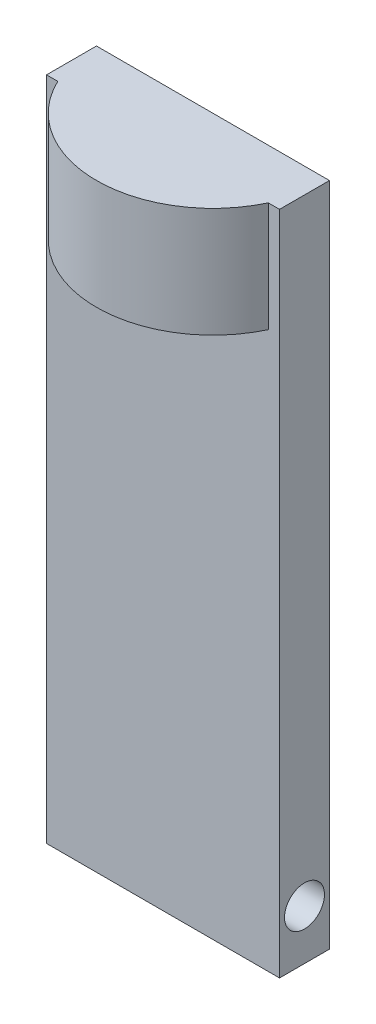
ISO-10303-21;
HEADER;
FILE_DESCRIPTION(('STEP AP214'),'2;1');
FILE_NAME('part.step','',(''),(''),'','','');
FILE_SCHEMA(('AUTOMOTIVE_DESIGN { 1 0 10303 214 1 1 1 1 }'));
ENDSEC;
DATA;
#1=APPLICATION_CONTEXT('core data for automotive mechanical design processes');
#2=APPLICATION_PROTOCOL_DEFINITION('international standard','automotive_design',2000,#1);
#3=PRODUCT_CONTEXT('',#1,'mechanical');
#4=PRODUCT('Part','Part','',(#3));
#5=PRODUCT_RELATED_PRODUCT_CATEGORY('part','',(#4));
#6=PRODUCT_DEFINITION_FORMATION('','',#4);
#7=PRODUCT_DEFINITION_CONTEXT('part definition',#1,'design');
#8=PRODUCT_DEFINITION('design','',#6,#7);
#9=PRODUCT_DEFINITION_SHAPE('','',#8);
#10=(LENGTH_UNIT() NAMED_UNIT(*) SI_UNIT(.MILLI.,.METRE.));
#11=(NAMED_UNIT(*) PLANE_ANGLE_UNIT() SI_UNIT($,.RADIAN.));
#12=(NAMED_UNIT(*) SI_UNIT($,.STERADIAN.) SOLID_ANGLE_UNIT());
#13=UNCERTAINTY_MEASURE_WITH_UNIT(LENGTH_MEASURE(1.E-05),#10,'distance_accuracy_value','');
#14=(GEOMETRIC_REPRESENTATION_CONTEXT(3) GLOBAL_UNCERTAINTY_ASSIGNED_CONTEXT((#13)) GLOBAL_UNIT_ASSIGNED_CONTEXT((#10,
#11,#12)) REPRESENTATION_CONTEXT('',''));
#15=CARTESIAN_POINT('',(0.,0.,0.));
#16=DIRECTION('',(0.,0.,1.));
#17=DIRECTION('',(1.,0.,0.));
#18=AXIS2_PLACEMENT_3D('',#15,#16,#17);
#19=CARTESIAN_POINT('',(35.,100.,15.));
#20=DIRECTION('',(-1.,0.,0.));
#21=DIRECTION('',(0.,-1.,0.));
#22=AXIS2_PLACEMENT_3D('',#19,#20,#21);
#23=PLANE('',#22);
#24=CARTESIAN_POINT('',(35.,-85.,7.5));
#25=DIRECTION('',(1.,0.,0.));
#26=DIRECTION('',(0.,1.,0.));
#27=AXIS2_PLACEMENT_3D('',#24,#25,#26);
#28=CIRCLE('',#27,6.);
#29=CARTESIAN_POINT('',(35.,-79.,7.5));
#30=VERTEX_POINT('',#29);
#31=EDGE_CURVE('E122',#30,#30,#28,.T.);
#32=ORIENTED_EDGE('',*,*,#31,.F.);
#33=EDGE_LOOP('',(#32));
#34=FACE_BOUND('',#33,.T.);
#35=DIRECTION('',(0.,1.,0.));
#36=VECTOR('',#35,1.);
#37=CARTESIAN_POINT('',(35.,100.,0.));
#38=LINE('',#37,#36);
#39=CARTESIAN_POINT('',(35.,-100.,0.));
#40=VERTEX_POINT('',#39);
#41=CARTESIAN_POINT('',(35.,100.,0.));
#42=VERTEX_POINT('',#41);
#43=EDGE_CURVE('E128',#40,#42,#38,.T.);
#44=ORIENTED_EDGE('',*,*,#43,.T.);
#45=DIRECTION('',(0.,0.,-1.));
#46=VECTOR('',#45,1.);
#47=CARTESIAN_POINT('',(35.,100.,15.));
#48=LINE('',#47,#46);
#49=CARTESIAN_POINT('',(35.,100.,15.));
#50=VERTEX_POINT('',#49);
#51=EDGE_CURVE('E11',#50,#42,#48,.T.);
#52=ORIENTED_EDGE('',*,*,#51,.F.);
#53=DIRECTION('',(0.,1.,0.));
#54=VECTOR('',#53,1.);
#55=CARTESIAN_POINT('',(35.,100.,15.));
#56=LINE('',#55,#54);
#57=CARTESIAN_POINT('',(35.,-100.,15.));
#58=VERTEX_POINT('',#57);
#59=EDGE_CURVE('E102',#58,#50,#56,.T.);
#60=ORIENTED_EDGE('',*,*,#59,.F.);
#61=DIRECTION('',(0.,0.,-1.));
#62=VECTOR('',#61,1.);
#63=CARTESIAN_POINT('',(35.,-100.,15.));
#64=LINE('',#63,#62);
#65=EDGE_CURVE('E141',#58,#40,#64,.T.);
#66=ORIENTED_EDGE('',*,*,#65,.T.);
#67=EDGE_LOOP('',(#44,#52,#60,#66));
#68=FACE_BOUND('',#67,.T.);
#69=ADVANCED_FACE('F42',(#34,#68),#23,.F.);
#70=CARTESIAN_POINT('',(-35.,100.,15.));
#71=DIRECTION('',(0.,-1.,0.));
#72=DIRECTION('',(0.,0.,-1.));
#73=AXIS2_PLACEMENT_3D('',#70,#71,#72);
#74=PLANE('',#73);
#75=DIRECTION('',(-1.,0.,0.));
#76=VECTOR('',#75,1.);
#77=CARTESIAN_POINT('',(-35.,100.,0.));
#78=LINE('',#77,#76);
#79=CARTESIAN_POINT('',(-35.,100.,0.));
#80=VERTEX_POINT('',#79);
#81=EDGE_CURVE('E145',#42,#80,#78,.T.);
#82=ORIENTED_EDGE('',*,*,#81,.T.);
#83=DIRECTION('',(0.,0.,-1.));
#84=VECTOR('',#83,1.);
#85=CARTESIAN_POINT('',(-35.,100.,15.));
#86=LINE('',#85,#84);
#87=CARTESIAN_POINT('',(-35.,100.,15.));
#88=VERTEX_POINT('',#87);
#89=EDGE_CURVE('E50',#88,#80,#86,.T.);
#90=ORIENTED_EDGE('',*,*,#89,.F.);
#91=DIRECTION('',(-1.,0.,0.));
#92=VECTOR('',#91,1.);
#93=CARTESIAN_POINT('',(-35.,100.,15.));
#94=LINE('',#93,#92);
#95=CARTESIAN_POINT('',(-31.6227766016838,100.,15.));
#96=VERTEX_POINT('',#95);
#97=EDGE_CURVE('E94',#96,#88,#94,.T.);
#98=ORIENTED_EDGE('',*,*,#97,.F.);
#99=CARTESIAN_POINT('',(0.,100.,0.));
#100=DIRECTION('',(0.,1.,0.));
#101=DIRECTION('',(0.,0.,1.));
#102=AXIS2_PLACEMENT_3D('',#99,#100,#101);
#103=CIRCLE('',#102,35.);
#104=CARTESIAN_POINT('',(31.6227766016838,100.,15.));
#105=VERTEX_POINT('',#104);
#106=EDGE_CURVE('E97',#96,#105,#103,.T.);
#107=ORIENTED_EDGE('',*,*,#106,.T.);
#108=EDGE_CURVE('E101',#50,#105,#94,.T.);
#109=ORIENTED_EDGE('',*,*,#108,.F.);
#110=ORIENTED_EDGE('',*,*,#51,.T.);
#111=EDGE_LOOP('',(#82,#90,#98,#107,#109,#110));
#112=FACE_BOUND('',#111,.T.);
#113=ADVANCED_FACE('F95',(#112),#74,.F.);
#114=CARTESIAN_POINT('',(-35.,100.,15.));
#115=DIRECTION('',(1.,0.,0.));
#116=DIRECTION('',(0.,1.,0.));
#117=AXIS2_PLACEMENT_3D('',#114,#115,#116);
#118=PLANE('',#117);
#119=CARTESIAN_POINT('',(-35.,-85.,7.5));
#120=DIRECTION('',(1.,0.,0.));
#121=DIRECTION('',(0.,1.,0.));
#122=AXIS2_PLACEMENT_3D('',#119,#120,#121);
#123=CIRCLE('',#122,6.);
#124=CARTESIAN_POINT('',(-35.,-79.,7.5));
#125=VERTEX_POINT('',#124);
#126=EDGE_CURVE('E124',#125,#125,#123,.T.);
#127=ORIENTED_EDGE('',*,*,#126,.T.);
#128=EDGE_LOOP('',(#127));
#129=FACE_BOUND('',#128,.T.);
#130=DIRECTION('',(0.,-1.,0.));
#131=VECTOR('',#130,1.);
#132=CARTESIAN_POINT('',(-35.,100.,0.));
#133=LINE('',#132,#131);
#134=CARTESIAN_POINT('',(-35.,-100.,0.));
#135=VERTEX_POINT('',#134);
#136=EDGE_CURVE('E148',#80,#135,#133,.T.);
#137=ORIENTED_EDGE('',*,*,#136,.T.);
#138=DIRECTION('',(0.,0.,-1.));
#139=VECTOR('',#138,1.);
#140=CARTESIAN_POINT('',(-35.,-100.,15.));
#141=LINE('',#140,#139);
#142=CARTESIAN_POINT('',(-35.,-100.,15.));
#143=VERTEX_POINT('',#142);
#144=EDGE_CURVE('E156',#143,#135,#141,.T.);
#145=ORIENTED_EDGE('',*,*,#144,.F.);
#146=DIRECTION('',(0.,-1.,0.));
#147=VECTOR('',#146,1.);
#148=CARTESIAN_POINT('',(-35.,100.,15.));
#149=LINE('',#148,#147);
#150=EDGE_CURVE('E136',#88,#143,#149,.T.);
#151=ORIENTED_EDGE('',*,*,#150,.F.);
#152=ORIENTED_EDGE('',*,*,#89,.T.);
#153=EDGE_LOOP('',(#137,#145,#151,#152));
#154=FACE_BOUND('',#153,.T.);
#155=ADVANCED_FACE('F163',(#129,#154),#118,.F.);
#156=CARTESIAN_POINT('',(-35.,-100.,15.));
#157=DIRECTION('',(0.,1.,0.));
#158=DIRECTION('',(0.,0.,1.));
#159=AXIS2_PLACEMENT_3D('',#156,#157,#158);
#160=PLANE('',#159);
#161=DIRECTION('',(1.,0.,0.));
#162=VECTOR('',#161,1.);
#163=CARTESIAN_POINT('',(-35.,-100.,0.));
#164=LINE('',#163,#162);
#165=EDGE_CURVE('E133',#135,#40,#164,.T.);
#166=ORIENTED_EDGE('',*,*,#165,.T.);
#167=ORIENTED_EDGE('',*,*,#65,.F.);
#168=DIRECTION('',(1.,0.,0.));
#169=VECTOR('',#168,1.);
#170=CARTESIAN_POINT('',(-35.,-100.,15.));
#171=LINE('',#170,#169);
#172=EDGE_CURVE('E139',#143,#58,#171,.T.);
#173=ORIENTED_EDGE('',*,*,#172,.F.);
#174=ORIENTED_EDGE('',*,*,#144,.T.);
#175=EDGE_LOOP('',(#166,#167,#173,#174));
#176=FACE_BOUND('',#175,.T.);
#177=ADVANCED_FACE('F171',(#176),#160,.F.);
#178=CARTESIAN_POINT('',(0.,0.,15.));
#179=DIRECTION('',(0.,0.,1.));
#180=DIRECTION('',(1.,0.,0.));
#181=AXIS2_PLACEMENT_3D('',#178,#179,#180);
#182=PLANE('',#181);
#183=DIRECTION('',(0.,1.,0.));
#184=VECTOR('',#183,1.);
#185=CARTESIAN_POINT('',(31.6227766016838,67.,15.));
#186=LINE('',#185,#184);
#187=CARTESIAN_POINT('',(31.6227766016838,67.,15.));
#188=VERTEX_POINT('',#187);
#189=EDGE_CURVE('E62',#188,#105,#186,.T.);
#190=ORIENTED_EDGE('',*,*,#189,.F.);
#191=DIRECTION('',(1.,0.,0.));
#192=VECTOR('',#191,1.);
#193=CARTESIAN_POINT('',(0.,67.,15.));
#194=LINE('',#193,#192);
#195=CARTESIAN_POINT('',(-31.6227766016838,67.,15.));
#196=VERTEX_POINT('',#195);
#197=EDGE_CURVE('E57',#196,#188,#194,.T.);
#198=ORIENTED_EDGE('',*,*,#197,.F.);
#199=DIRECTION('',(0.,1.,0.));
#200=VECTOR('',#199,1.);
#201=CARTESIAN_POINT('',(-31.6227766016838,67.,15.));
#202=LINE('',#201,#200);
#203=EDGE_CURVE('E104',#196,#96,#202,.T.);
#204=ORIENTED_EDGE('',*,*,#203,.T.);
#205=ORIENTED_EDGE('',*,*,#97,.T.);
#206=ORIENTED_EDGE('',*,*,#150,.T.);
#207=ORIENTED_EDGE('',*,*,#172,.T.);
#208=ORIENTED_EDGE('',*,*,#59,.T.);
#209=ORIENTED_EDGE('',*,*,#108,.T.);
#210=EDGE_LOOP('',(#190,#198,#204,#205,#206,#207,#208,#209));
#211=FACE_BOUND('',#210,.T.);
#212=ADVANCED_FACE('F105',(#211),#182,.T.);
#213=CARTESIAN_POINT('',(0.,0.,0.));
#214=DIRECTION('',(0.,0.,1.));
#215=DIRECTION('',(1.,0.,0.));
#216=AXIS2_PLACEMENT_3D('',#213,#214,#215);
#217=PLANE('',#216);
#218=ORIENTED_EDGE('',*,*,#43,.F.);
#219=ORIENTED_EDGE('',*,*,#165,.F.);
#220=ORIENTED_EDGE('',*,*,#136,.F.);
#221=ORIENTED_EDGE('',*,*,#81,.F.);
#222=EDGE_LOOP('',(#218,#219,#220,#221));
#223=FACE_BOUND('',#222,.T.);
#224=ADVANCED_FACE('F168',(#223),#217,.F.);
#225=CARTESIAN_POINT('',(-35.,-85.,7.5));
#226=DIRECTION('',(1.,0.,0.));
#227=DIRECTION('',(0.,1.,0.));
#228=AXIS2_PLACEMENT_3D('',#225,#226,#227);
#229=CYLINDRICAL_SURFACE('',#228,6.);
#230=ORIENTED_EDGE('',*,*,#126,.F.);
#231=EDGE_LOOP('',(#230));
#232=FACE_BOUND('',#231,.T.);
#233=ORIENTED_EDGE('',*,*,#31,.T.);
#234=EDGE_LOOP('',(#233));
#235=FACE_BOUND('',#234,.T.);
#236=ADVANCED_FACE('F183',(#232,#235),#229,.F.);
#237=CARTESIAN_POINT('',(0.,67.,0.));
#238=DIRECTION('',(0.,1.,0.));
#239=DIRECTION('',(0.,0.,1.));
#240=AXIS2_PLACEMENT_3D('',#237,#238,#239);
#241=CYLINDRICAL_SURFACE('',#240,35.);
#242=ORIENTED_EDGE('',*,*,#106,.F.);
#243=ORIENTED_EDGE('',*,*,#203,.F.);
#244=CARTESIAN_POINT('',(0.,67.,0.));
#245=DIRECTION('',(0.,1.,0.));
#246=DIRECTION('',(0.,0.,1.));
#247=AXIS2_PLACEMENT_3D('',#244,#245,#246);
#248=CIRCLE('',#247,35.);
#249=EDGE_CURVE('E110',#196,#188,#248,.T.);
#250=ORIENTED_EDGE('',*,*,#249,.T.);
#251=ORIENTED_EDGE('',*,*,#189,.T.);
#252=EDGE_LOOP('',(#242,#243,#250,#251));
#253=FACE_BOUND('',#252,.T.);
#254=ADVANCED_FACE('F112',(#253),#241,.T.);
#255=CARTESIAN_POINT('',(0.,67.,0.));
#256=DIRECTION('',(0.,1.,0.));
#257=DIRECTION('',(0.,0.,1.));
#258=AXIS2_PLACEMENT_3D('',#255,#256,#257);
#259=PLANE('',#258);
#260=ORIENTED_EDGE('',*,*,#197,.T.);
#261=ORIENTED_EDGE('',*,*,#249,.F.);
#262=EDGE_LOOP('',(#260,#261));
#263=FACE_BOUND('',#262,.T.);
#264=ADVANCED_FACE('F191',(#263),#259,.F.);
#265=CLOSED_SHELL('',(#69,#113,#155,#177,#212,#224,#236,#254,#264));
#266=MANIFOLD_SOLID_BREP('B2',#265);
#267=ADVANCED_BREP_SHAPE_REPRESENTATION('',(#18,#266),#14);
#268=SHAPE_DEFINITION_REPRESENTATION(#9,#267);
ENDSEC;
END-ISO-10303-21;
